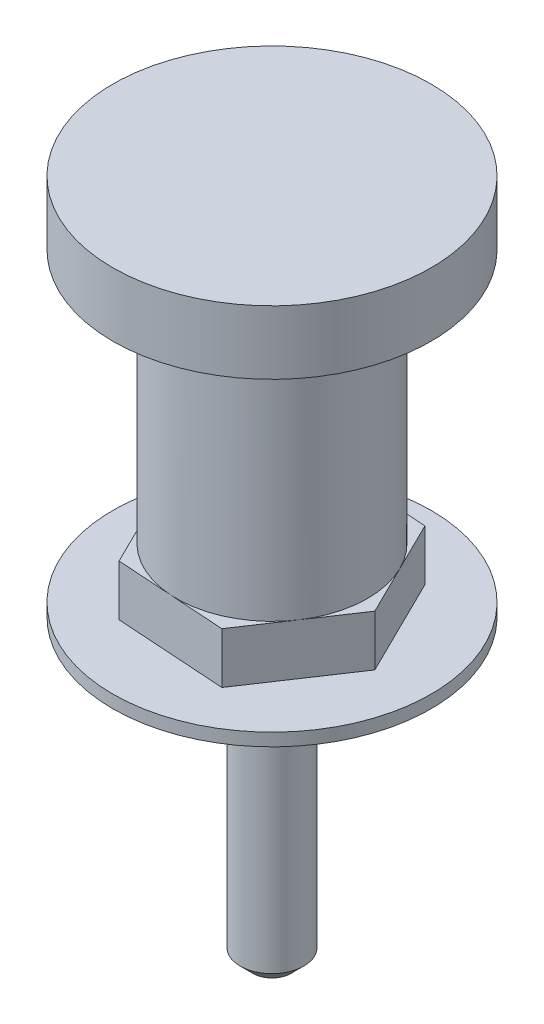
ISO-10303-21;
HEADER;
FILE_DESCRIPTION(('STEP AP214'),'2;1');
FILE_NAME('part.step','',(''),(''),'','','');
FILE_SCHEMA(('AUTOMOTIVE_DESIGN { 1 0 10303 214 1 1 1 1 }'));
ENDSEC;
DATA;
#1=APPLICATION_CONTEXT('core data for automotive mechanical design processes');
#2=APPLICATION_PROTOCOL_DEFINITION('international standard','automotive_design',2000,#1);
#3=PRODUCT_CONTEXT('',#1,'mechanical');
#4=PRODUCT('Part','Part','',(#3));
#5=PRODUCT_RELATED_PRODUCT_CATEGORY('part','',(#4));
#6=PRODUCT_DEFINITION_FORMATION('','',#4);
#7=PRODUCT_DEFINITION_CONTEXT('part definition',#1,'design');
#8=PRODUCT_DEFINITION('design','',#6,#7);
#9=PRODUCT_DEFINITION_SHAPE('','',#8);
#10=(LENGTH_UNIT() NAMED_UNIT(*) SI_UNIT(.MILLI.,.METRE.));
#11=(NAMED_UNIT(*) PLANE_ANGLE_UNIT() SI_UNIT($,.RADIAN.));
#12=(NAMED_UNIT(*) SI_UNIT($,.STERADIAN.) SOLID_ANGLE_UNIT());
#13=UNCERTAINTY_MEASURE_WITH_UNIT(LENGTH_MEASURE(1.E-05),#10,'distance_accuracy_value','');
#14=(GEOMETRIC_REPRESENTATION_CONTEXT(3) GLOBAL_UNCERTAINTY_ASSIGNED_CONTEXT((#13)) GLOBAL_UNIT_ASSIGNED_CONTEXT((#10,
#11,#12)) REPRESENTATION_CONTEXT('',''));
#15=CARTESIAN_POINT('',(0.,0.,0.));
#16=DIRECTION('',(0.,0.,1.));
#17=DIRECTION('',(1.,0.,0.));
#18=AXIS2_PLACEMENT_3D('',#15,#16,#17);
#19=CARTESIAN_POINT('',(0.,5.,0.));
#20=DIRECTION('',(0.,1.,0.));
#21=DIRECTION('',(0.,0.,1.));
#22=AXIS2_PLACEMENT_3D('',#19,#20,#21);
#23=PLANE('',#22);
#24=CARTESIAN_POINT('',(0.,5.,0.));
#25=DIRECTION('',(0.,1.,0.));
#26=DIRECTION('',(0.,0.,1.));
#27=AXIS2_PLACEMENT_3D('',#24,#25,#26);
#28=CIRCLE('',#27,7.5);
#29=CARTESIAN_POINT('',(6.23619587726525,5.,4.16651664827826));
#30=VERTEX_POINT('',#29);
#31=CARTESIAN_POINT('',(6.72640720133239,5.,-3.31744572854836));
#32=VERTEX_POINT('',#31);
#33=EDGE_CURVE('E51',#30,#32,#28,.T.);
#34=ORIENTED_EDGE('',*,*,#33,.F.);
#35=DIRECTION('',(0.555535553103768,0.,-0.831492783635367));
#36=VECTOR('',#35,1.);
#37=CARTESIAN_POINT('',(3.83065636879873,5.,7.76698601673659));
#38=LINE('',#37,#36);
#39=CARTESIAN_POINT('',(8.64173538573176,5.,0.566047279819933));
#40=VERTEX_POINT('',#39);
#41=EDGE_CURVE('E126',#30,#40,#38,.T.);
#42=ORIENTED_EDGE('',*,*,#41,.T.);
#43=DIRECTION('',(-0.442326097139781,0.,-0.896854293510986));
#44=VECTOR('',#43,1.);
#45=CARTESIAN_POINT('',(8.64173538573176,5.,0.566047279819933));
#46=LINE('',#45,#44);
#47=EDGE_CURVE('E139',#40,#32,#46,.T.);
#48=ORIENTED_EDGE('',*,*,#47,.T.);
#49=EDGE_LOOP('',(#34,#42,#48));
#50=FACE_BOUND('',#49,.T.);
#51=ADVANCED_FACE('F39',(#50),#23,.T.);
#52=CARTESIAN_POINT('',(0.490211324067146,5.,-7.48396237682662));
#53=VERTEX_POINT('',#52);
#54=EDGE_CURVE('E11',#32,#53,#28,.T.);
#55=ORIENTED_EDGE('',*,*,#54,.F.);
#56=CARTESIAN_POINT('',(4.81107901693302,5.,-7.20093873691666));
#57=VERTEX_POINT('',#56);
#58=EDGE_CURVE('E125',#32,#57,#46,.T.);
#59=ORIENTED_EDGE('',*,*,#58,.T.);
#60=DIRECTION('',(-0.997861650243549,0.,-0.0653615098756194));
#61=VECTOR('',#60,1.);
#62=CARTESIAN_POINT('',(4.81107901693302,5.,-7.20093873691666));
#63=LINE('',#62,#61);
#64=EDGE_CURVE('E156',#57,#53,#63,.T.);
#65=ORIENTED_EDGE('',*,*,#64,.T.);
#66=EDGE_LOOP('',(#55,#59,#65));
#67=FACE_BOUND('',#66,.T.);
#68=ADVANCED_FACE('F222',(#67),#23,.T.);
#69=CARTESIAN_POINT('',(-6.23619587726525,5.,-4.16651664827827));
#70=VERTEX_POINT('',#69);
#71=EDGE_CURVE('E49',#53,#70,#28,.T.);
#72=ORIENTED_EDGE('',*,*,#71,.F.);
#73=CARTESIAN_POINT('',(-3.83065636879874,5.,-7.76698601673659));
#74=VERTEX_POINT('',#73);
#75=EDGE_CURVE('E155',#53,#74,#63,.T.);
#76=ORIENTED_EDGE('',*,*,#75,.T.);
#77=DIRECTION('',(-0.555535553103768,0.,0.831492783635366));
#78=VECTOR('',#77,1.);
#79=CARTESIAN_POINT('',(-3.83065636879874,5.,-7.76698601673659));
#80=LINE('',#79,#78);
#81=EDGE_CURVE('E160',#74,#70,#80,.T.);
#82=ORIENTED_EDGE('',*,*,#81,.T.);
#83=EDGE_LOOP('',(#72,#76,#82));
#84=FACE_BOUND('',#83,.T.);
#85=ADVANCED_FACE('F227',(#84),#23,.T.);
#86=CARTESIAN_POINT('',(-6.7264072013324,5.,3.31744572854836));
#87=VERTEX_POINT('',#86);
#88=EDGE_CURVE('E66',#70,#87,#28,.T.);
#89=ORIENTED_EDGE('',*,*,#88,.F.);
#90=CARTESIAN_POINT('',(-8.64173538573176,5.,-0.56604727981994));
#91=VERTEX_POINT('',#90);
#92=EDGE_CURVE('E159',#70,#91,#80,.T.);
#93=ORIENTED_EDGE('',*,*,#92,.T.);
#94=DIRECTION('',(0.442326097139781,0.,0.896854293510986));
#95=VECTOR('',#94,1.);
#96=CARTESIAN_POINT('',(-8.64173538573176,5.,-0.56604727981994));
#97=LINE('',#96,#95);
#98=EDGE_CURVE('E164',#91,#87,#97,.T.);
#99=ORIENTED_EDGE('',*,*,#98,.T.);
#100=EDGE_LOOP('',(#89,#93,#99));
#101=FACE_BOUND('',#100,.T.);
#102=ADVANCED_FACE('F242',(#101),#23,.T.);
#103=CARTESIAN_POINT('',(-0.490211324067146,5.,7.48396237682662));
#104=VERTEX_POINT('',#103);
#105=EDGE_CURVE('E58',#87,#104,#28,.T.);
#106=ORIENTED_EDGE('',*,*,#105,.F.);
#107=CARTESIAN_POINT('',(-4.81107901693303,5.,7.20093873691665));
#108=VERTEX_POINT('',#107);
#109=EDGE_CURVE('E163',#87,#108,#97,.T.);
#110=ORIENTED_EDGE('',*,*,#109,.T.);
#111=DIRECTION('',(0.997861650243549,0.,0.0653615098756194));
#112=VECTOR('',#111,1.);
#113=CARTESIAN_POINT('',(-4.81107901693303,5.,7.20093873691665));
#114=LINE('',#113,#112);
#115=EDGE_CURVE('E137',#108,#104,#114,.T.);
#116=ORIENTED_EDGE('',*,*,#115,.T.);
#117=EDGE_LOOP('',(#106,#110,#116));
#118=FACE_BOUND('',#117,.T.);
#119=ADVANCED_FACE('F233',(#118),#23,.T.);
#120=CARTESIAN_POINT('',(0.,1.,0.));
#121=DIRECTION('',(0.,-1.,0.));
#122=DIRECTION('',(0.,0.,-1.));
#123=AXIS2_PLACEMENT_3D('',#120,#121,#122);
#124=CYLINDRICAL_SURFACE('',#123,12.5);
#125=CARTESIAN_POINT('',(0.,1.,0.));
#126=DIRECTION('',(0.,1.,0.));
#127=DIRECTION('',(0.,0.,1.));
#128=AXIS2_PLACEMENT_3D('',#125,#126,#127);
#129=CIRCLE('',#128,12.5);
#130=CARTESIAN_POINT('',(0.,1.,12.5));
#131=VERTEX_POINT('',#130);
#132=EDGE_CURVE('E198',#131,#131,#129,.T.);
#133=ORIENTED_EDGE('',*,*,#132,.F.);
#134=EDGE_LOOP('',(#133));
#135=FACE_BOUND('',#134,.T.);
#136=CARTESIAN_POINT('',(0.,0.,0.));
#137=DIRECTION('',(0.,1.,0.));
#138=DIRECTION('',(0.,0.,1.));
#139=AXIS2_PLACEMENT_3D('',#136,#137,#138);
#140=CIRCLE('',#139,12.5);
#141=CARTESIAN_POINT('',(0.,0.,12.5));
#142=VERTEX_POINT('',#141);
#143=EDGE_CURVE('E197',#142,#142,#140,.T.);
#144=ORIENTED_EDGE('',*,*,#143,.T.);
#145=EDGE_LOOP('',(#144));
#146=FACE_BOUND('',#145,.T.);
#147=ADVANCED_FACE('F241',(#135,#146),#124,.T.);
#148=CARTESIAN_POINT('',(0.,1.,0.));
#149=DIRECTION('',(0.,1.,0.));
#150=DIRECTION('',(0.,0.,1.));
#151=AXIS2_PLACEMENT_3D('',#148,#149,#150);
#152=PLANE('',#151);
#153=DIRECTION('',(0.997861650243549,0.,0.0653615098756194));
#154=VECTOR('',#153,1.);
#155=CARTESIAN_POINT('',(-4.81107901693303,1.,7.20093873691665));
#156=LINE('',#155,#154);
#157=CARTESIAN_POINT('',(-4.81107901693303,1.,7.20093873691665));
#158=VERTEX_POINT('',#157);
#159=CARTESIAN_POINT('',(3.83065636879873,1.,7.76698601673659));
#160=VERTEX_POINT('',#159);
#161=EDGE_CURVE('E152',#158,#160,#156,.T.);
#162=ORIENTED_EDGE('',*,*,#161,.F.);
#163=DIRECTION('',(0.442326097139781,0.,0.896854293510986));
#164=VECTOR('',#163,1.);
#165=CARTESIAN_POINT('',(-8.64173538573176,1.,-0.56604727981994));
#166=LINE('',#165,#164);
#167=CARTESIAN_POINT('',(-8.64173538573176,1.,-0.56604727981994));
#168=VERTEX_POINT('',#167);
#169=EDGE_CURVE('E180',#168,#158,#166,.T.);
#170=ORIENTED_EDGE('',*,*,#169,.F.);
#171=DIRECTION('',(-0.555535553103768,0.,0.831492783635366));
#172=VECTOR('',#171,1.);
#173=CARTESIAN_POINT('',(-3.83065636879874,1.,-7.76698601673659));
#174=LINE('',#173,#172);
#175=CARTESIAN_POINT('',(-3.83065636879874,1.,-7.76698601673659));
#176=VERTEX_POINT('',#175);
#177=EDGE_CURVE('E177',#176,#168,#174,.T.);
#178=ORIENTED_EDGE('',*,*,#177,.F.);
#179=DIRECTION('',(-0.997861650243549,0.,-0.0653615098756194));
#180=VECTOR('',#179,1.);
#181=CARTESIAN_POINT('',(4.81107901693302,1.,-7.20093873691666));
#182=LINE('',#181,#180);
#183=CARTESIAN_POINT('',(4.81107901693302,1.,-7.20093873691666));
#184=VERTEX_POINT('',#183);
#185=EDGE_CURVE('E174',#184,#176,#182,.T.);
#186=ORIENTED_EDGE('',*,*,#185,.F.);
#187=DIRECTION('',(-0.442326097139781,0.,-0.896854293510986));
#188=VECTOR('',#187,1.);
#189=CARTESIAN_POINT('',(8.64173538573176,1.,0.566047279819933));
#190=LINE('',#189,#188);
#191=CARTESIAN_POINT('',(8.64173538573176,1.,0.566047279819933));
#192=VERTEX_POINT('',#191);
#193=EDGE_CURVE('E171',#192,#184,#190,.T.);
#194=ORIENTED_EDGE('',*,*,#193,.F.);
#195=DIRECTION('',(0.555535553103768,0.,-0.831492783635367));
#196=VECTOR('',#195,1.);
#197=CARTESIAN_POINT('',(3.83065636879873,1.,7.76698601673659));
#198=LINE('',#197,#196);
#199=EDGE_CURVE('E169',#160,#192,#198,.T.);
#200=ORIENTED_EDGE('',*,*,#199,.F.);
#201=EDGE_LOOP('',(#162,#170,#178,#186,#194,#200));
#202=FACE_BOUND('',#201,.T.);
#203=ORIENTED_EDGE('',*,*,#132,.T.);
#204=EDGE_LOOP('',(#203));
#205=FACE_BOUND('',#204,.T.);
#206=ADVANCED_FACE('F247',(#202,#205),#152,.T.);
#207=CARTESIAN_POINT('',(0.,0.,0.));
#208=DIRECTION('',(0.,1.,0.));
#209=DIRECTION('',(0.,0.,1.));
#210=AXIS2_PLACEMENT_3D('',#207,#208,#209);
#211=PLANE('',#210);
#212=CARTESIAN_POINT('',(0.,0.,0.));
#213=DIRECTION('',(0.,1.,0.));
#214=DIRECTION('',(0.,0.,1.));
#215=AXIS2_PLACEMENT_3D('',#212,#213,#214);
#216=CIRCLE('',#215,2.5);
#217=CARTESIAN_POINT('',(0.,0.,2.5));
#218=VERTEX_POINT('',#217);
#219=EDGE_CURVE('E149',#218,#218,#216,.T.);
#220=ORIENTED_EDGE('',*,*,#219,.T.);
#221=EDGE_LOOP('',(#220));
#222=FACE_BOUND('',#221,.T.);
#223=ORIENTED_EDGE('',*,*,#143,.F.);
#224=EDGE_LOOP('',(#223));
#225=FACE_BOUND('',#224,.T.);
#226=ADVANCED_FACE('F276',(#222,#225),#211,.F.);
#227=CARTESIAN_POINT('',(-4.81107901693303,5.,7.20093873691665));
#228=DIRECTION('',(0.0653615098756194,0.,-0.997861650243549));
#229=DIRECTION('',(-0.997861650243549,0.,-0.0653615098756195));
#230=AXIS2_PLACEMENT_3D('',#227,#228,#229);
#231=PLANE('',#230);
#232=ORIENTED_EDGE('',*,*,#161,.T.);
#233=DIRECTION('',(0.,-1.,0.));
#234=VECTOR('',#233,1.);
#235=CARTESIAN_POINT('',(3.83065636879873,5.,7.76698601673659));
#236=LINE('',#235,#234);
#237=CARTESIAN_POINT('',(3.83065636879873,5.,7.76698601673659));
#238=VERTEX_POINT('',#237);
#239=EDGE_CURVE('E195',#238,#160,#236,.T.);
#240=ORIENTED_EDGE('',*,*,#239,.F.);
#241=EDGE_CURVE('E121',#104,#238,#114,.T.);
#242=ORIENTED_EDGE('',*,*,#241,.F.);
#243=ORIENTED_EDGE('',*,*,#115,.F.);
#244=DIRECTION('',(0.,-1.,0.));
#245=VECTOR('',#244,1.);
#246=CARTESIAN_POINT('',(-4.81107901693303,5.,7.20093873691665));
#247=LINE('',#246,#245);
#248=EDGE_CURVE('E166',#108,#158,#247,.T.);
#249=ORIENTED_EDGE('',*,*,#248,.T.);
#250=EDGE_LOOP('',(#232,#240,#242,#243,#249));
#251=FACE_BOUND('',#250,.T.);
#252=ADVANCED_FACE('F273',(#251),#231,.F.);
#253=CARTESIAN_POINT('',(3.83065636879873,5.,7.76698601673659));
#254=DIRECTION('',(-0.831492783635367,0.,-0.555535553103768));
#255=DIRECTION('',(-0.555535553103768,0.,0.831492783635367));
#256=AXIS2_PLACEMENT_3D('',#253,#254,#255);
#257=PLANE('',#256);
#258=ORIENTED_EDGE('',*,*,#199,.T.);
#259=DIRECTION('',(0.,-1.,0.));
#260=VECTOR('',#259,1.);
#261=CARTESIAN_POINT('',(8.64173538573176,5.,0.566047279819933));
#262=LINE('',#261,#260);
#263=EDGE_CURVE('E133',#40,#192,#262,.T.);
#264=ORIENTED_EDGE('',*,*,#263,.F.);
#265=ORIENTED_EDGE('',*,*,#41,.F.);
#266=EDGE_CURVE('E115',#238,#30,#38,.T.);
#267=ORIENTED_EDGE('',*,*,#266,.F.);
#268=ORIENTED_EDGE('',*,*,#239,.T.);
#269=EDGE_LOOP('',(#258,#264,#265,#267,#268));
#270=FACE_BOUND('',#269,.T.);
#271=ADVANCED_FACE('F131',(#270),#257,.F.);
#272=CARTESIAN_POINT('',(8.64173538573176,5.,0.566047279819933));
#273=DIRECTION('',(-0.896854293510986,0.,0.442326097139781));
#274=DIRECTION('',(0.442326097139781,0.,0.896854293510986));
#275=AXIS2_PLACEMENT_3D('',#272,#273,#274);
#276=PLANE('',#275);
#277=ORIENTED_EDGE('',*,*,#193,.T.);
#278=DIRECTION('',(0.,-1.,0.));
#279=VECTOR('',#278,1.);
#280=CARTESIAN_POINT('',(4.81107901693302,5.,-7.20093873691666));
#281=LINE('',#280,#279);
#282=EDGE_CURVE('E191',#57,#184,#281,.T.);
#283=ORIENTED_EDGE('',*,*,#282,.F.);
#284=ORIENTED_EDGE('',*,*,#58,.F.);
#285=ORIENTED_EDGE('',*,*,#47,.F.);
#286=ORIENTED_EDGE('',*,*,#263,.T.);
#287=EDGE_LOOP('',(#277,#283,#284,#285,#286));
#288=FACE_BOUND('',#287,.T.);
#289=ADVANCED_FACE('F265',(#288),#276,.F.);
#290=CARTESIAN_POINT('',(4.81107901693302,5.,-7.20093873691666));
#291=DIRECTION('',(-0.0653615098756194,0.,0.997861650243549));
#292=DIRECTION('',(0.997861650243549,0.,0.0653615098756194));
#293=AXIS2_PLACEMENT_3D('',#290,#291,#292);
#294=PLANE('',#293);
#295=ORIENTED_EDGE('',*,*,#185,.T.);
#296=DIRECTION('',(0.,-1.,0.));
#297=VECTOR('',#296,1.);
#298=CARTESIAN_POINT('',(-3.83065636879874,5.,-7.76698601673659));
#299=LINE('',#298,#297);
#300=EDGE_CURVE('E188',#74,#176,#299,.T.);
#301=ORIENTED_EDGE('',*,*,#300,.F.);
#302=ORIENTED_EDGE('',*,*,#75,.F.);
#303=ORIENTED_EDGE('',*,*,#64,.F.);
#304=ORIENTED_EDGE('',*,*,#282,.T.);
#305=EDGE_LOOP('',(#295,#301,#302,#303,#304));
#306=FACE_BOUND('',#305,.T.);
#307=ADVANCED_FACE('F261',(#306),#294,.F.);
#308=CARTESIAN_POINT('',(-3.83065636879874,5.,-7.76698601673659));
#309=DIRECTION('',(0.831492783635366,0.,0.555535553103768));
#310=DIRECTION('',(0.555535553103768,0.,-0.831492783635366));
#311=AXIS2_PLACEMENT_3D('',#308,#309,#310);
#312=PLANE('',#311);
#313=ORIENTED_EDGE('',*,*,#177,.T.);
#314=DIRECTION('',(0.,-1.,0.));
#315=VECTOR('',#314,1.);
#316=CARTESIAN_POINT('',(-8.64173538573176,5.,-0.56604727981994));
#317=LINE('',#316,#315);
#318=EDGE_CURVE('E185',#91,#168,#317,.T.);
#319=ORIENTED_EDGE('',*,*,#318,.F.);
#320=ORIENTED_EDGE('',*,*,#92,.F.);
#321=ORIENTED_EDGE('',*,*,#81,.F.);
#322=ORIENTED_EDGE('',*,*,#300,.T.);
#323=EDGE_LOOP('',(#313,#319,#320,#321,#322));
#324=FACE_BOUND('',#323,.T.);
#325=ADVANCED_FACE('F238',(#324),#312,.F.);
#326=CARTESIAN_POINT('',(-8.64173538573176,5.,-0.56604727981994));
#327=DIRECTION('',(0.896854293510986,0.,-0.442326097139781));
#328=DIRECTION('',(-0.442326097139781,0.,-0.896854293510986));
#329=AXIS2_PLACEMENT_3D('',#326,#327,#328);
#330=PLANE('',#329);
#331=ORIENTED_EDGE('',*,*,#169,.T.);
#332=ORIENTED_EDGE('',*,*,#248,.F.);
#333=ORIENTED_EDGE('',*,*,#109,.F.);
#334=ORIENTED_EDGE('',*,*,#98,.F.);
#335=ORIENTED_EDGE('',*,*,#318,.T.);
#336=EDGE_LOOP('',(#331,#332,#333,#334,#335));
#337=FACE_BOUND('',#336,.T.);
#338=ADVANCED_FACE('F232',(#337),#330,.F.);
#339=EDGE_CURVE('E119',#104,#30,#28,.T.);
#340=ORIENTED_EDGE('',*,*,#339,.F.);
#341=ORIENTED_EDGE('',*,*,#241,.T.);
#342=ORIENTED_EDGE('',*,*,#266,.T.);
#343=EDGE_LOOP('',(#340,#341,#342));
#344=FACE_BOUND('',#343,.T.);
#345=ADVANCED_FACE('F117',(#344),#23,.T.);
#346=CARTESIAN_POINT('',(0.,-23.5,0.));
#347=DIRECTION('',(0.,1.,0.));
#348=DIRECTION('',(0.,0.,1.));
#349=AXIS2_PLACEMENT_3D('',#346,#347,#348);
#350=CYLINDRICAL_SURFACE('',#349,2.5);
#351=CARTESIAN_POINT('',(0.,-22.5,0.));
#352=DIRECTION('',(0.,1.,0.));
#353=DIRECTION('',(0.,0.,1.));
#354=AXIS2_PLACEMENT_3D('',#351,#352,#353);
#355=CIRCLE('',#354,2.5);
#356=CARTESIAN_POINT('',(0.,-22.5,2.5));
#357=VERTEX_POINT('',#356);
#358=EDGE_CURVE('E145',#357,#357,#355,.T.);
#359=ORIENTED_EDGE('',*,*,#358,.T.);
#360=EDGE_LOOP('',(#359));
#361=FACE_BOUND('',#360,.T.);
#362=ORIENTED_EDGE('',*,*,#219,.F.);
#363=EDGE_LOOP('',(#362));
#364=FACE_BOUND('',#363,.T.);
#365=ADVANCED_FACE('F205',(#361,#364),#350,.T.);
#366=CARTESIAN_POINT('',(0.,-23.5,0.));
#367=DIRECTION('',(0.,1.,0.));
#368=DIRECTION('',(0.,0.,1.));
#369=AXIS2_PLACEMENT_3D('',#366,#367,#368);
#370=PLANE('',#369);
#371=CARTESIAN_POINT('',(0.,-23.5,0.));
#372=DIRECTION('',(0.,1.,0.));
#373=DIRECTION('',(0.,0.,1.));
#374=AXIS2_PLACEMENT_3D('',#371,#372,#373);
#375=CIRCLE('',#374,1.49999999999998);
#376=CARTESIAN_POINT('',(0.,-23.5,1.49999999999998));
#377=VERTEX_POINT('',#376);
#378=EDGE_CURVE('E44',#377,#377,#375,.F.);
#379=ORIENTED_EDGE('',*,*,#378,.T.);
#380=EDGE_LOOP('',(#379));
#381=FACE_BOUND('',#380,.T.);
#382=ADVANCED_FACE('F209',(#381),#370,.F.);
#383=CARTESIAN_POINT('',(0.,-22.5,0.));
#384=DIRECTION('',(0.,1.,0.));
#385=DIRECTION('',(0.,0.,1.));
#386=AXIS2_PLACEMENT_3D('',#383,#384,#385);
#387=CONICAL_SURFACE('',#386,2.5,0.785398163397449);
#388=ORIENTED_EDGE('',*,*,#378,.F.);
#389=EDGE_LOOP('',(#388));
#390=FACE_BOUND('',#389,.T.);
#391=ORIENTED_EDGE('',*,*,#358,.F.);
#392=EDGE_LOOP('',(#391));
#393=FACE_BOUND('',#392,.T.);
#394=ADVANCED_FACE('F42',(#390,#393),#387,.T.);
#395=CARTESIAN_POINT('',(0.,25.,0.));
#396=DIRECTION('',(0.,-1.,0.));
#397=DIRECTION('',(0.,0.,-1.));
#398=AXIS2_PLACEMENT_3D('',#395,#396,#397);
#399=CYLINDRICAL_SURFACE('',#398,7.5);
#400=CARTESIAN_POINT('',(0.,25.,0.));
#401=DIRECTION('',(0.,1.,0.));
#402=DIRECTION('',(0.,0.,1.));
#403=AXIS2_PLACEMENT_3D('',#400,#401,#402);
#404=CIRCLE('',#403,7.5);
#405=CARTESIAN_POINT('',(0.,25.,7.5));
#406=VERTEX_POINT('',#405);
#407=EDGE_CURVE('E141',#406,#406,#404,.T.);
#408=ORIENTED_EDGE('',*,*,#407,.F.);
#409=EDGE_LOOP('',(#408));
#410=FACE_BOUND('',#409,.T.);
#411=ORIENTED_EDGE('',*,*,#33,.T.);
#412=ORIENTED_EDGE('',*,*,#54,.T.);
#413=ORIENTED_EDGE('',*,*,#71,.T.);
#414=ORIENTED_EDGE('',*,*,#88,.T.);
#415=ORIENTED_EDGE('',*,*,#105,.T.);
#416=ORIENTED_EDGE('',*,*,#339,.T.);
#417=EDGE_LOOP('',(#411,#412,#413,#414,#415,#416));
#418=FACE_BOUND('',#417,.T.);
#419=ADVANCED_FACE('F143',(#410,#418),#399,.T.);
#420=CARTESIAN_POINT('',(0.,30.,0.));
#421=DIRECTION('',(0.,-1.,0.));
#422=DIRECTION('',(0.,0.,-1.));
#423=AXIS2_PLACEMENT_3D('',#420,#421,#422);
#424=CYLINDRICAL_SURFACE('',#423,12.5);
#425=CARTESIAN_POINT('',(0.,30.,0.));
#426=DIRECTION('',(0.,1.,0.));
#427=DIRECTION('',(0.,0.,1.));
#428=AXIS2_PLACEMENT_3D('',#425,#426,#427);
#429=CIRCLE('',#428,12.5);
#430=CARTESIAN_POINT('',(0.,30.,12.5));
#431=VERTEX_POINT('',#430);
#432=EDGE_CURVE('E142',#431,#431,#429,.T.);
#433=ORIENTED_EDGE('',*,*,#432,.F.);
#434=EDGE_LOOP('',(#433));
#435=FACE_BOUND('',#434,.T.);
#436=CARTESIAN_POINT('',(0.,25.,0.));
#437=DIRECTION('',(0.,1.,0.));
#438=DIRECTION('',(0.,0.,1.));
#439=AXIS2_PLACEMENT_3D('',#436,#437,#438);
#440=CIRCLE('',#439,12.5);
#441=CARTESIAN_POINT('',(0.,25.,12.5));
#442=VERTEX_POINT('',#441);
#443=EDGE_CURVE('E475',#442,#442,#440,.T.);
#444=ORIENTED_EDGE('',*,*,#443,.T.);
#445=EDGE_LOOP('',(#444));
#446=FACE_BOUND('',#445,.T.);
#447=ADVANCED_FACE('F215',(#435,#446),#424,.T.);
#448=CARTESIAN_POINT('',(0.,30.,0.));
#449=DIRECTION('',(0.,1.,0.));
#450=DIRECTION('',(0.,0.,1.));
#451=AXIS2_PLACEMENT_3D('',#448,#449,#450);
#452=PLANE('',#451);
#453=ORIENTED_EDGE('',*,*,#432,.T.);
#454=EDGE_LOOP('',(#453));
#455=FACE_BOUND('',#454,.T.);
#456=ADVANCED_FACE('F329',(#455),#452,.T.);
#457=CARTESIAN_POINT('',(0.,25.,0.));
#458=DIRECTION('',(0.,1.,0.));
#459=DIRECTION('',(0.,0.,1.));
#460=AXIS2_PLACEMENT_3D('',#457,#458,#459);
#461=PLANE('',#460);
#462=ORIENTED_EDGE('',*,*,#407,.T.);
#463=EDGE_LOOP('',(#462));
#464=FACE_BOUND('',#463,.T.);
#465=ORIENTED_EDGE('',*,*,#443,.F.);
#466=EDGE_LOOP('',(#465));
#467=FACE_BOUND('',#466,.T.);
#468=ADVANCED_FACE('F340',(#464,#467),#461,.F.);
#469=CLOSED_SHELL('',(#51,#68,#85,#102,#119,#147,#206,#226,#252,#271,#289,#307,#325,#338,#345,
#365,#382,#394,#419,#447,#456,#468));
#470=MANIFOLD_SOLID_BREP('B2',#469);
#471=ADVANCED_BREP_SHAPE_REPRESENTATION('',(#18,#470),#14);
#472=SHAPE_DEFINITION_REPRESENTATION(#9,#471);
ENDSEC;
END-ISO-10303-21;
